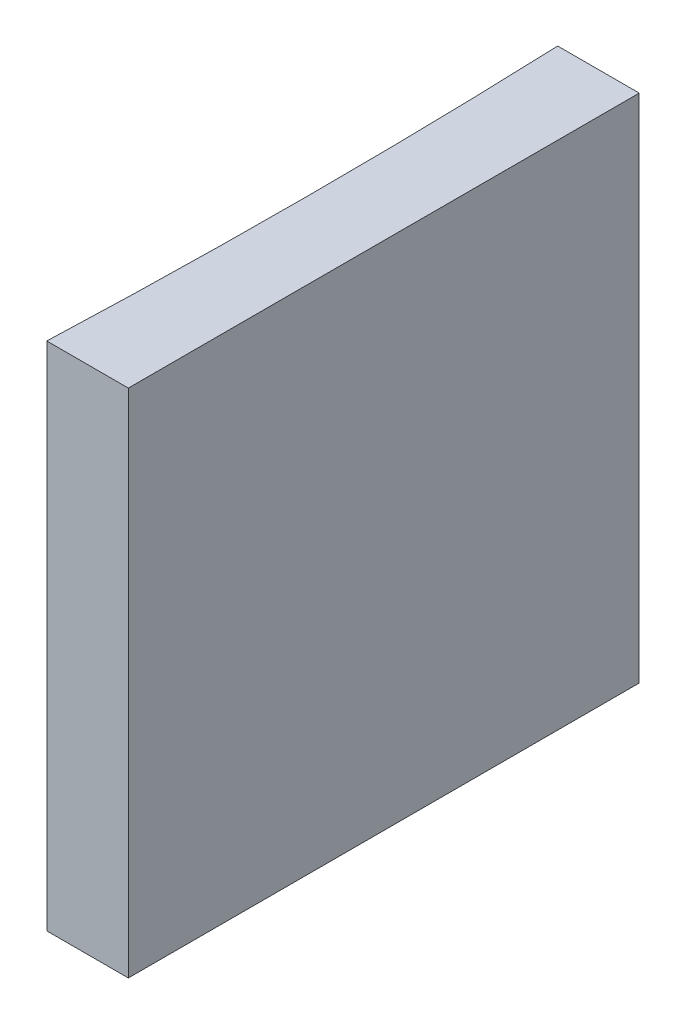
ISO-10303-21;
HEADER;
FILE_DESCRIPTION(('STEP AP214'),'2;1');
FILE_NAME('part.step','',(''),(''),'','','');
FILE_SCHEMA(('AUTOMOTIVE_DESIGN { 1 0 10303 214 1 1 1 1 }'));
ENDSEC;
DATA;
#1=APPLICATION_CONTEXT('core data for automotive mechanical design processes');
#2=APPLICATION_PROTOCOL_DEFINITION('international standard','automotive_design',2000,#1);
#3=PRODUCT_CONTEXT('',#1,'mechanical');
#4=PRODUCT('Part','Part','',(#3));
#5=PRODUCT_RELATED_PRODUCT_CATEGORY('part','',(#4));
#6=PRODUCT_DEFINITION_FORMATION('','',#4);
#7=PRODUCT_DEFINITION_CONTEXT('part definition',#1,'design');
#8=PRODUCT_DEFINITION('design','',#6,#7);
#9=PRODUCT_DEFINITION_SHAPE('','',#8);
#10=(LENGTH_UNIT() NAMED_UNIT(*) SI_UNIT(.MILLI.,.METRE.));
#11=(NAMED_UNIT(*) PLANE_ANGLE_UNIT() SI_UNIT($,.RADIAN.));
#12=(NAMED_UNIT(*) SI_UNIT($,.STERADIAN.) SOLID_ANGLE_UNIT());
#13=UNCERTAINTY_MEASURE_WITH_UNIT(LENGTH_MEASURE(1.E-05),#10,'distance_accuracy_value','');
#14=(GEOMETRIC_REPRESENTATION_CONTEXT(3) GLOBAL_UNCERTAINTY_ASSIGNED_CONTEXT((#13)) GLOBAL_UNIT_ASSIGNED_CONTEXT((#10,
#11,#12)) REPRESENTATION_CONTEXT('',''));
#15=CARTESIAN_POINT('',(0.,0.,0.));
#16=DIRECTION('',(0.,0.,1.));
#17=DIRECTION('',(1.,0.,0.));
#18=AXIS2_PLACEMENT_3D('',#15,#16,#17);
#19=CARTESIAN_POINT('',(0.,20.,0.));
#20=DIRECTION('',(0.,0.,1.));
#21=DIRECTION('',(1.,0.,0.));
#22=AXIS2_PLACEMENT_3D('',#19,#20,#21);
#23=PLANE('',#22);
#24=DIRECTION('',(-1.,0.,0.));
#25=VECTOR('',#24,1.);
#26=CARTESIAN_POINT('',(0.,0.,0.));
#27=LINE('',#26,#25);
#28=CARTESIAN_POINT('',(0.,0.,0.));
#29=VERTEX_POINT('',#28);
#30=CARTESIAN_POINT('',(-3.19349601684438,0.,0.));
#31=VERTEX_POINT('',#30);
#32=EDGE_CURVE('E100',#29,#31,#27,.T.);
#33=ORIENTED_EDGE('',*,*,#32,.T.);
#34=DIRECTION('',(0.,-1.,0.));
#35=VECTOR('',#34,1.);
#36=CARTESIAN_POINT('',(-3.19349601684438,20.,0.));
#37=LINE('',#36,#35);
#38=CARTESIAN_POINT('',(-3.19349601684438,20.,0.));
#39=VERTEX_POINT('',#38);
#40=EDGE_CURVE('E11',#39,#31,#37,.T.);
#41=ORIENTED_EDGE('',*,*,#40,.F.);
#42=DIRECTION('',(-1.,0.,0.));
#43=VECTOR('',#42,1.);
#44=CARTESIAN_POINT('',(0.,20.,0.));
#45=LINE('',#44,#43);
#46=CARTESIAN_POINT('',(0.,20.,0.));
#47=VERTEX_POINT('',#46);
#48=EDGE_CURVE('E88',#47,#39,#45,.T.);
#49=ORIENTED_EDGE('',*,*,#48,.F.);
#50=DIRECTION('',(0.,-1.,0.));
#51=VECTOR('',#50,1.);
#52=CARTESIAN_POINT('',(0.,20.,0.));
#53=LINE('',#52,#51);
#54=EDGE_CURVE('E96',#47,#29,#53,.T.);
#55=ORIENTED_EDGE('',*,*,#54,.T.);
#56=EDGE_LOOP('',(#33,#41,#49,#55));
#57=FACE_BOUND('',#56,.T.);
#58=ADVANCED_FACE('F37',(#57),#23,.F.);
#59=CARTESIAN_POINT('',(-261.5,20.,10.));
#60=DIRECTION('',(0.,-1.,0.));
#61=DIRECTION('',(0.,0.,-1.));
#62=AXIS2_PLACEMENT_3D('',#59,#60,#61);
#63=CYLINDRICAL_SURFACE('',#62,258.5);
#64=CARTESIAN_POINT('',(-261.5,0.,10.));
#65=DIRECTION('',(0.,-1.,0.));
#66=DIRECTION('',(0.,0.,1.));
#67=AXIS2_PLACEMENT_3D('',#64,#65,#66);
#68=CIRCLE('',#67,258.5);
#69=CARTESIAN_POINT('',(-3.19349601684438,0.,20.));
#70=VERTEX_POINT('',#69);
#71=EDGE_CURVE('E92',#31,#70,#68,.T.);
#72=ORIENTED_EDGE('',*,*,#71,.T.);
#73=DIRECTION('',(0.,-1.,0.));
#74=VECTOR('',#73,1.);
#75=CARTESIAN_POINT('',(-3.19349601684438,20.,20.));
#76=LINE('',#75,#74);
#77=CARTESIAN_POINT('',(-3.19349601684438,20.,20.));
#78=VERTEX_POINT('',#77);
#79=EDGE_CURVE('E45',#78,#70,#76,.T.);
#80=ORIENTED_EDGE('',*,*,#79,.F.);
#81=CARTESIAN_POINT('',(-261.5,20.,10.));
#82=DIRECTION('',(0.,-1.,0.));
#83=DIRECTION('',(0.,0.,1.));
#84=AXIS2_PLACEMENT_3D('',#81,#82,#83);
#85=CIRCLE('',#84,258.5);
#86=EDGE_CURVE('E83',#39,#78,#85,.T.);
#87=ORIENTED_EDGE('',*,*,#86,.F.);
#88=ORIENTED_EDGE('',*,*,#40,.T.);
#89=EDGE_LOOP('',(#72,#80,#87,#88));
#90=FACE_BOUND('',#89,.T.);
#91=ADVANCED_FACE('F91',(#90),#63,.F.);
#92=CARTESIAN_POINT('',(0.,20.,20.));
#93=DIRECTION('',(0.,0.,-1.));
#94=DIRECTION('',(-1.,0.,0.));
#95=AXIS2_PLACEMENT_3D('',#92,#93,#94);
#96=PLANE('',#95);
#97=DIRECTION('',(1.,0.,0.));
#98=VECTOR('',#97,1.);
#99=CARTESIAN_POINT('',(0.,0.,20.));
#100=LINE('',#99,#98);
#101=CARTESIAN_POINT('',(0.,0.,20.));
#102=VERTEX_POINT('',#101);
#103=EDGE_CURVE('E70',#70,#102,#100,.T.);
#104=ORIENTED_EDGE('',*,*,#103,.T.);
#105=DIRECTION('',(0.,-1.,0.));
#106=VECTOR('',#105,1.);
#107=CARTESIAN_POINT('',(0.,20.,20.));
#108=LINE('',#107,#106);
#109=CARTESIAN_POINT('',(0.,20.,20.));
#110=VERTEX_POINT('',#109);
#111=EDGE_CURVE('E93',#110,#102,#108,.T.);
#112=ORIENTED_EDGE('',*,*,#111,.F.);
#113=DIRECTION('',(1.,0.,0.));
#114=VECTOR('',#113,1.);
#115=CARTESIAN_POINT('',(0.,20.,20.));
#116=LINE('',#115,#114);
#117=EDGE_CURVE('E86',#78,#110,#116,.T.);
#118=ORIENTED_EDGE('',*,*,#117,.F.);
#119=ORIENTED_EDGE('',*,*,#79,.T.);
#120=EDGE_LOOP('',(#104,#112,#118,#119));
#121=FACE_BOUND('',#120,.T.);
#122=ADVANCED_FACE('F94',(#121),#96,.F.);
#123=CARTESIAN_POINT('',(0.,20.,0.));
#124=DIRECTION('',(-1.,0.,0.));
#125=DIRECTION('',(0.,0.,1.));
#126=AXIS2_PLACEMENT_3D('',#123,#124,#125);
#127=PLANE('',#126);
#128=DIRECTION('',(0.,0.,-1.));
#129=VECTOR('',#128,1.);
#130=CARTESIAN_POINT('',(0.,0.,0.));
#131=LINE('',#130,#129);
#132=EDGE_CURVE('E76',#102,#29,#131,.T.);
#133=ORIENTED_EDGE('',*,*,#132,.T.);
#134=ORIENTED_EDGE('',*,*,#54,.F.);
#135=DIRECTION('',(0.,0.,-1.));
#136=VECTOR('',#135,1.);
#137=CARTESIAN_POINT('',(0.,20.,0.));
#138=LINE('',#137,#136);
#139=EDGE_CURVE('E53',#110,#47,#138,.T.);
#140=ORIENTED_EDGE('',*,*,#139,.F.);
#141=ORIENTED_EDGE('',*,*,#111,.T.);
#142=EDGE_LOOP('',(#133,#134,#140,#141));
#143=FACE_BOUND('',#142,.T.);
#144=ADVANCED_FACE('F107',(#143),#127,.F.);
#145=CARTESIAN_POINT('',(-261.5,20.,10.));
#146=DIRECTION('',(0.,1.,0.));
#147=DIRECTION('',(0.,0.,1.));
#148=AXIS2_PLACEMENT_3D('',#145,#146,#147);
#149=PLANE('',#148);
#150=ORIENTED_EDGE('',*,*,#48,.T.);
#151=ORIENTED_EDGE('',*,*,#86,.T.);
#152=ORIENTED_EDGE('',*,*,#117,.T.);
#153=ORIENTED_EDGE('',*,*,#139,.T.);
#154=EDGE_LOOP('',(#150,#151,#152,#153));
#155=FACE_BOUND('',#154,.T.);
#156=ADVANCED_FACE('F84',(#155),#149,.T.);
#157=CARTESIAN_POINT('',(-261.5,0.,10.));
#158=DIRECTION('',(0.,1.,0.));
#159=DIRECTION('',(0.,0.,1.));
#160=AXIS2_PLACEMENT_3D('',#157,#158,#159);
#161=PLANE('',#160);
#162=ORIENTED_EDGE('',*,*,#32,.F.);
#163=ORIENTED_EDGE('',*,*,#132,.F.);
#164=ORIENTED_EDGE('',*,*,#103,.F.);
#165=ORIENTED_EDGE('',*,*,#71,.F.);
#166=EDGE_LOOP('',(#162,#163,#164,#165));
#167=FACE_BOUND('',#166,.T.);
#168=ADVANCED_FACE('F110',(#167),#161,.F.);
#169=CLOSED_SHELL('',(#58,#91,#122,#144,#156,#168));
#170=MANIFOLD_SOLID_BREP('B2',#169);
#171=ADVANCED_BREP_SHAPE_REPRESENTATION('',(#18,#170),#14);
#172=SHAPE_DEFINITION_REPRESENTATION(#9,#171);
ENDSEC;
END-ISO-10303-21;
